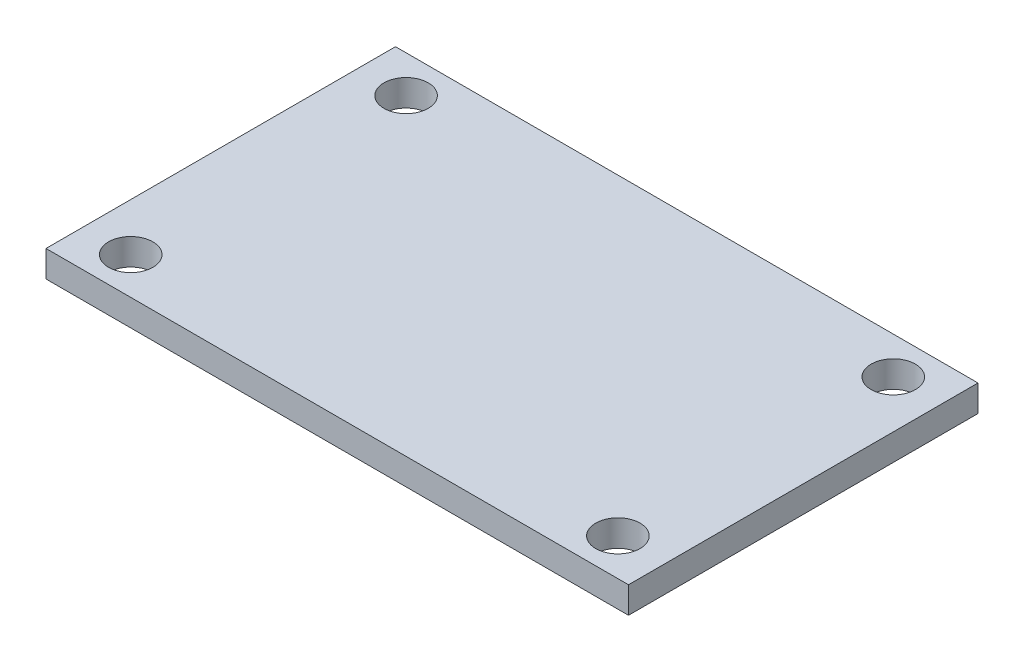
ISO-10303-21;
HEADER;
FILE_DESCRIPTION(('STEP AP214'),'2;1');
FILE_NAME('part.step','',(''),(''),'','','');
FILE_SCHEMA(('AUTOMOTIVE_DESIGN { 1 0 10303 214 1 1 1 1 }'));
ENDSEC;
DATA;
#1=APPLICATION_CONTEXT('core data for automotive mechanical design processes');
#2=APPLICATION_PROTOCOL_DEFINITION('international standard','automotive_design',2000,#1);
#3=PRODUCT_CONTEXT('',#1,'mechanical');
#4=PRODUCT('Part','Part','',(#3));
#5=PRODUCT_RELATED_PRODUCT_CATEGORY('part','',(#4));
#6=PRODUCT_DEFINITION_FORMATION('','',#4);
#7=PRODUCT_DEFINITION_CONTEXT('part definition',#1,'design');
#8=PRODUCT_DEFINITION('design','',#6,#7);
#9=PRODUCT_DEFINITION_SHAPE('','',#8);
#10=(LENGTH_UNIT() NAMED_UNIT(*) SI_UNIT(.MILLI.,.METRE.));
#11=(NAMED_UNIT(*) PLANE_ANGLE_UNIT() SI_UNIT($,.RADIAN.));
#12=(NAMED_UNIT(*) SI_UNIT($,.STERADIAN.) SOLID_ANGLE_UNIT());
#13=UNCERTAINTY_MEASURE_WITH_UNIT(LENGTH_MEASURE(1.E-05),#10,'distance_accuracy_value','');
#14=(GEOMETRIC_REPRESENTATION_CONTEXT(3) GLOBAL_UNCERTAINTY_ASSIGNED_CONTEXT((#13)) GLOBAL_UNIT_ASSIGNED_CONTEXT((#10,
#11,#12)) REPRESENTATION_CONTEXT('',''));
#15=CARTESIAN_POINT('',(0.,0.,0.));
#16=DIRECTION('',(0.,0.,1.));
#17=DIRECTION('',(1.,0.,0.));
#18=AXIS2_PLACEMENT_3D('',#15,#16,#17);
#19=CARTESIAN_POINT('',(-42.7686190505824,3.175,-22.2551637593528));
#20=DIRECTION('',(1.,0.,0.));
#21=DIRECTION('',(0.,0.,-1.));
#22=AXIS2_PLACEMENT_3D('',#19,#20,#21);
#23=PLANE('',#22);
#24=DIRECTION('',(0.,0.,1.));
#25=VECTOR('',#24,1.);
#26=CARTESIAN_POINT('',(-42.7686190505824,0.,-22.2551637593528));
#27=LINE('',#26,#25);
#28=CARTESIAN_POINT('',(-42.7686190505824,0.,-22.2551637593528));
#29=VERTEX_POINT('',#28);
#30=CARTESIAN_POINT('',(-42.7686190505824,0.,19.6548362406472));
#31=VERTEX_POINT('',#30);
#32=EDGE_CURVE('E128',#29,#31,#27,.T.);
#33=ORIENTED_EDGE('',*,*,#32,.T.);
#34=DIRECTION('',(0.,-1.,0.));
#35=VECTOR('',#34,1.);
#36=CARTESIAN_POINT('',(-42.7686190505824,3.175,19.6548362406472));
#37=LINE('',#36,#35);
#38=CARTESIAN_POINT('',(-42.7686190505824,3.175,19.6548362406472));
#39=VERTEX_POINT('',#38);
#40=EDGE_CURVE('E144',#39,#31,#37,.T.);
#41=ORIENTED_EDGE('',*,*,#40,.F.);
#42=DIRECTION('',(0.,0.,1.));
#43=VECTOR('',#42,1.);
#44=CARTESIAN_POINT('',(-42.7686190505824,3.175,-22.2551637593528));
#45=LINE('',#44,#43);
#46=CARTESIAN_POINT('',(-42.7686190505824,3.175,-22.2551637593528));
#47=VERTEX_POINT('',#46);
#48=EDGE_CURVE('E117',#47,#39,#45,.T.);
#49=ORIENTED_EDGE('',*,*,#48,.F.);
#50=DIRECTION('',(0.,-1.,0.));
#51=VECTOR('',#50,1.);
#52=CARTESIAN_POINT('',(-42.7686190505824,3.175,-22.2551637593528));
#53=LINE('',#52,#51);
#54=EDGE_CURVE('E127',#47,#29,#53,.T.);
#55=ORIENTED_EDGE('',*,*,#54,.T.);
#56=EDGE_LOOP('',(#33,#41,#49,#55));
#57=FACE_BOUND('',#56,.T.);
#58=ADVANCED_FACE('F35',(#57),#23,.F.);
#59=CARTESIAN_POINT('',(-42.7686190505824,3.175,19.6548362406472));
#60=DIRECTION('',(0.,0.,-1.));
#61=DIRECTION('',(-1.,0.,0.));
#62=AXIS2_PLACEMENT_3D('',#59,#60,#61);
#63=PLANE('',#62);
#64=DIRECTION('',(1.,0.,0.));
#65=VECTOR('',#64,1.);
#66=CARTESIAN_POINT('',(-42.7686190505824,0.,19.6548362406472));
#67=LINE('',#66,#65);
#68=CARTESIAN_POINT('',(27.0813809494176,0.,19.6548362406472));
#69=VERTEX_POINT('',#68);
#70=EDGE_CURVE('E131',#31,#69,#67,.T.);
#71=ORIENTED_EDGE('',*,*,#70,.T.);
#72=DIRECTION('',(0.,-1.,0.));
#73=VECTOR('',#72,1.);
#74=CARTESIAN_POINT('',(27.0813809494176,3.175,19.6548362406472));
#75=LINE('',#74,#73);
#76=CARTESIAN_POINT('',(27.0813809494176,3.175,19.6548362406472));
#77=VERTEX_POINT('',#76);
#78=EDGE_CURVE('E141',#77,#69,#75,.T.);
#79=ORIENTED_EDGE('',*,*,#78,.F.);
#80=DIRECTION('',(1.,0.,0.));
#81=VECTOR('',#80,1.);
#82=CARTESIAN_POINT('',(-42.7686190505824,3.175,19.6548362406472));
#83=LINE('',#82,#81);
#84=EDGE_CURVE('E120',#39,#77,#83,.T.);
#85=ORIENTED_EDGE('',*,*,#84,.F.);
#86=ORIENTED_EDGE('',*,*,#40,.T.);
#87=EDGE_LOOP('',(#71,#79,#85,#86));
#88=FACE_BOUND('',#87,.T.);
#89=ADVANCED_FACE('F184',(#88),#63,.F.);
#90=CARTESIAN_POINT('',(27.0813809494176,3.175,-22.2551637593528));
#91=DIRECTION('',(-1.,0.,0.));
#92=DIRECTION('',(0.,0.,1.));
#93=AXIS2_PLACEMENT_3D('',#90,#91,#92);
#94=PLANE('',#93);
#95=DIRECTION('',(0.,0.,-1.));
#96=VECTOR('',#95,1.);
#97=CARTESIAN_POINT('',(27.0813809494176,0.,-22.2551637593528));
#98=LINE('',#97,#96);
#99=CARTESIAN_POINT('',(27.0813809494176,0.,-22.2551637593528));
#100=VERTEX_POINT('',#99);
#101=EDGE_CURVE('E133',#69,#100,#98,.T.);
#102=ORIENTED_EDGE('',*,*,#101,.T.);
#103=DIRECTION('',(0.,-1.,0.));
#104=VECTOR('',#103,1.);
#105=CARTESIAN_POINT('',(27.0813809494176,3.175,-22.2551637593528));
#106=LINE('',#105,#104);
#107=CARTESIAN_POINT('',(27.0813809494176,3.175,-22.2551637593528));
#108=VERTEX_POINT('',#107);
#109=EDGE_CURVE('E138',#108,#100,#106,.T.);
#110=ORIENTED_EDGE('',*,*,#109,.F.);
#111=DIRECTION('',(0.,0.,-1.));
#112=VECTOR('',#111,1.);
#113=CARTESIAN_POINT('',(27.0813809494176,3.175,-22.2551637593528));
#114=LINE('',#113,#112);
#115=EDGE_CURVE('E123',#77,#108,#114,.T.);
#116=ORIENTED_EDGE('',*,*,#115,.F.);
#117=ORIENTED_EDGE('',*,*,#78,.T.);
#118=EDGE_LOOP('',(#102,#110,#116,#117));
#119=FACE_BOUND('',#118,.T.);
#120=ADVANCED_FACE('F190',(#119),#94,.F.);
#121=CARTESIAN_POINT('',(-42.7686190505824,3.175,-22.2551637593528));
#122=DIRECTION('',(0.,0.,1.));
#123=DIRECTION('',(1.,0.,0.));
#124=AXIS2_PLACEMENT_3D('',#121,#122,#123);
#125=PLANE('',#124);
#126=DIRECTION('',(-1.,0.,0.));
#127=VECTOR('',#126,1.);
#128=CARTESIAN_POINT('',(-42.7686190505824,0.,-22.2551637593528));
#129=LINE('',#128,#127);
#130=EDGE_CURVE('E121',#100,#29,#129,.T.);
#131=ORIENTED_EDGE('',*,*,#130,.T.);
#132=ORIENTED_EDGE('',*,*,#54,.F.);
#133=DIRECTION('',(-1.,0.,0.));
#134=VECTOR('',#133,1.);
#135=CARTESIAN_POINT('',(-42.7686190505824,3.175,-22.2551637593528));
#136=LINE('',#135,#134);
#137=EDGE_CURVE('E125',#108,#47,#136,.T.);
#138=ORIENTED_EDGE('',*,*,#137,.F.);
#139=ORIENTED_EDGE('',*,*,#109,.T.);
#140=EDGE_LOOP('',(#131,#132,#138,#139));
#141=FACE_BOUND('',#140,.T.);
#142=ADVANCED_FACE('F177',(#141),#125,.F.);
#143=CARTESIAN_POINT('',(-42.7686190505824,3.175,19.6548362406472));
#144=DIRECTION('',(0.,1.,0.));
#145=DIRECTION('',(0.,0.,1.));
#146=AXIS2_PLACEMENT_3D('',#143,#144,#145);
#147=PLANE('',#146);
#148=CARTESIAN_POINT('',(-37.0536190505824,3.175,15.2098362406472));
#149=DIRECTION('',(0.,1.,0.));
#150=DIRECTION('',(0.,0.,1.));
#151=AXIS2_PLACEMENT_3D('',#148,#149,#150);
#152=CIRCLE('',#151,2.6543);
#153=CARTESIAN_POINT('',(-37.0536190505824,3.175,17.8641362406472));
#154=VERTEX_POINT('',#153);
#155=EDGE_CURVE('E101',#154,#154,#152,.T.);
#156=ORIENTED_EDGE('',*,*,#155,.F.);
#157=EDGE_LOOP('',(#156));
#158=FACE_BOUND('',#157,.T.);
#159=CARTESIAN_POINT('',(21.3663809494176,3.175,15.2098362406472));
#160=DIRECTION('',(0.,1.,0.));
#161=DIRECTION('',(0.,0.,1.));
#162=AXIS2_PLACEMENT_3D('',#159,#160,#161);
#163=CIRCLE('',#162,2.6543);
#164=CARTESIAN_POINT('',(21.3663809494176,3.175,17.8641362406472));
#165=VERTEX_POINT('',#164);
#166=EDGE_CURVE('E105',#165,#165,#163,.T.);
#167=ORIENTED_EDGE('',*,*,#166,.F.);
#168=EDGE_LOOP('',(#167));
#169=FACE_BOUND('',#168,.T.);
#170=CARTESIAN_POINT('',(21.3663809494176,3.175,-17.8101637593528));
#171=DIRECTION('',(0.,1.,0.));
#172=DIRECTION('',(0.,0.,1.));
#173=AXIS2_PLACEMENT_3D('',#170,#171,#172);
#174=CIRCLE('',#173,2.6543);
#175=CARTESIAN_POINT('',(21.3663809494176,3.175,-15.1558637593528));
#176=VERTEX_POINT('',#175);
#177=EDGE_CURVE('E109',#176,#176,#174,.T.);
#178=ORIENTED_EDGE('',*,*,#177,.F.);
#179=EDGE_LOOP('',(#178));
#180=FACE_BOUND('',#179,.T.);
#181=CARTESIAN_POINT('',(-37.0536190505824,3.175,-17.8101637593528));
#182=DIRECTION('',(0.,1.,0.));
#183=DIRECTION('',(0.,0.,1.));
#184=AXIS2_PLACEMENT_3D('',#181,#182,#183);
#185=CIRCLE('',#184,2.6543);
#186=CARTESIAN_POINT('',(-37.0536190505824,3.175,-15.1558637593528));
#187=VERTEX_POINT('',#186);
#188=EDGE_CURVE('E113',#187,#187,#185,.T.);
#189=ORIENTED_EDGE('',*,*,#188,.F.);
#190=EDGE_LOOP('',(#189));
#191=FACE_BOUND('',#190,.T.);
#192=ORIENTED_EDGE('',*,*,#48,.T.);
#193=ORIENTED_EDGE('',*,*,#84,.T.);
#194=ORIENTED_EDGE('',*,*,#115,.T.);
#195=ORIENTED_EDGE('',*,*,#137,.T.);
#196=EDGE_LOOP('',(#192,#193,#194,#195));
#197=FACE_BOUND('',#196,.T.);
#198=ADVANCED_FACE('F167',(#158,#169,#180,#191,#197),#147,.T.);
#199=CARTESIAN_POINT('',(-42.7686190505824,0.,19.6548362406472));
#200=DIRECTION('',(0.,1.,0.));
#201=DIRECTION('',(0.,0.,1.));
#202=AXIS2_PLACEMENT_3D('',#199,#200,#201);
#203=PLANE('',#202);
#204=CARTESIAN_POINT('',(13.7463809494176,0.,15.8448362406472));
#205=DIRECTION('',(0.,-1.,0.));
#206=DIRECTION('',(0.,0.,-1.));
#207=AXIS2_PLACEMENT_3D('',#204,#205,#206);
#208=CIRCLE('',#207,1.25);
#209=CARTESIAN_POINT('',(13.7463809494176,0.,14.5948362406472));
#210=VERTEX_POINT('',#209);
#211=EDGE_CURVE('E91',#210,#210,#208,.T.);
#212=ORIENTED_EDGE('',*,*,#211,.F.);
#213=EDGE_LOOP('',(#212));
#214=FACE_BOUND('',#213,.T.);
#215=CARTESIAN_POINT('',(-29.4336190505824,0.,15.8448362406472));
#216=DIRECTION('',(0.,-1.,0.));
#217=DIRECTION('',(0.,0.,-1.));
#218=AXIS2_PLACEMENT_3D('',#215,#216,#217);
#219=CIRCLE('',#218,1.25);
#220=CARTESIAN_POINT('',(-29.4336190505824,0.,14.5948362406472));
#221=VERTEX_POINT('',#220);
#222=EDGE_CURVE('E90',#221,#221,#219,.T.);
#223=ORIENTED_EDGE('',*,*,#222,.F.);
#224=EDGE_LOOP('',(#223));
#225=FACE_BOUND('',#224,.T.);
#226=CARTESIAN_POINT('',(-37.0536190505824,0.,15.2098362406472));
#227=DIRECTION('',(0.,1.,0.));
#228=DIRECTION('',(0.,0.,1.));
#229=AXIS2_PLACEMENT_3D('',#226,#227,#228);
#230=CIRCLE('',#229,2.6543);
#231=CARTESIAN_POINT('',(-37.0536190505824,0.,17.8641362406472));
#232=VERTEX_POINT('',#231);
#233=EDGE_CURVE('E104',#232,#232,#230,.T.);
#234=ORIENTED_EDGE('',*,*,#233,.T.);
#235=EDGE_LOOP('',(#234));
#236=FACE_BOUND('',#235,.T.);
#237=CARTESIAN_POINT('',(21.3663809494176,0.,15.2098362406472));
#238=DIRECTION('',(0.,1.,0.));
#239=DIRECTION('',(0.,0.,1.));
#240=AXIS2_PLACEMENT_3D('',#237,#238,#239);
#241=CIRCLE('',#240,2.6543);
#242=CARTESIAN_POINT('',(21.3663809494176,0.,17.8641362406472));
#243=VERTEX_POINT('',#242);
#244=EDGE_CURVE('E108',#243,#243,#241,.T.);
#245=ORIENTED_EDGE('',*,*,#244,.T.);
#246=EDGE_LOOP('',(#245));
#247=FACE_BOUND('',#246,.T.);
#248=CARTESIAN_POINT('',(21.3663809494176,0.,-17.8101637593528));
#249=DIRECTION('',(0.,1.,0.));
#250=DIRECTION('',(0.,0.,1.));
#251=AXIS2_PLACEMENT_3D('',#248,#249,#250);
#252=CIRCLE('',#251,2.6543);
#253=CARTESIAN_POINT('',(21.3663809494176,0.,-15.1558637593528));
#254=VERTEX_POINT('',#253);
#255=EDGE_CURVE('E112',#254,#254,#252,.T.);
#256=ORIENTED_EDGE('',*,*,#255,.T.);
#257=EDGE_LOOP('',(#256));
#258=FACE_BOUND('',#257,.T.);
#259=CARTESIAN_POINT('',(-37.0536190505824,0.,-17.8101637593528));
#260=DIRECTION('',(0.,1.,0.));
#261=DIRECTION('',(0.,0.,1.));
#262=AXIS2_PLACEMENT_3D('',#259,#260,#261);
#263=CIRCLE('',#262,2.6543);
#264=CARTESIAN_POINT('',(-37.0536190505824,0.,-15.1558637593528));
#265=VERTEX_POINT('',#264);
#266=EDGE_CURVE('E116',#265,#265,#263,.T.);
#267=ORIENTED_EDGE('',*,*,#266,.T.);
#268=EDGE_LOOP('',(#267));
#269=FACE_BOUND('',#268,.T.);
#270=ORIENTED_EDGE('',*,*,#32,.F.);
#271=ORIENTED_EDGE('',*,*,#130,.F.);
#272=ORIENTED_EDGE('',*,*,#101,.F.);
#273=ORIENTED_EDGE('',*,*,#70,.F.);
#274=EDGE_LOOP('',(#270,#271,#272,#273));
#275=FACE_BOUND('',#274,.T.);
#276=CARTESIAN_POINT('',(-29.4336190505824,0.,-18.4451637593528));
#277=DIRECTION('',(0.,-1.,0.));
#278=DIRECTION('',(0.,0.,-1.));
#279=AXIS2_PLACEMENT_3D('',#276,#277,#278);
#280=CIRCLE('',#279,1.25);
#281=CARTESIAN_POINT('',(-29.4336190505824,0.,-19.6951637593528));
#282=VERTEX_POINT('',#281);
#283=EDGE_CURVE('E147',#282,#282,#280,.T.);
#284=ORIENTED_EDGE('',*,*,#283,.F.);
#285=EDGE_LOOP('',(#284));
#286=FACE_BOUND('',#285,.T.);
#287=CARTESIAN_POINT('',(13.7463809494176,0.,-18.4451637593528));
#288=DIRECTION('',(0.,-1.,0.));
#289=DIRECTION('',(0.,0.,-1.));
#290=AXIS2_PLACEMENT_3D('',#287,#288,#289);
#291=CIRCLE('',#290,1.25);
#292=CARTESIAN_POINT('',(13.7463809494176,0.,-19.6951637593528));
#293=VERTEX_POINT('',#292);
#294=EDGE_CURVE('E43',#293,#293,#291,.T.);
#295=ORIENTED_EDGE('',*,*,#294,.F.);
#296=EDGE_LOOP('',(#295));
#297=FACE_BOUND('',#296,.T.);
#298=ADVANCED_FACE('F164',(#214,#225,#236,#247,#258,#269,#275,#286,#297),#203,.F.);
#299=CARTESIAN_POINT('',(-37.0536190505824,3.175,-17.8101637593528));
#300=DIRECTION('',(0.,1.,0.));
#301=DIRECTION('',(0.,0.,1.));
#302=AXIS2_PLACEMENT_3D('',#299,#300,#301);
#303=CYLINDRICAL_SURFACE('',#302,2.6543);
#304=ORIENTED_EDGE('',*,*,#188,.T.);
#305=EDGE_LOOP('',(#304));
#306=FACE_BOUND('',#305,.T.);
#307=ORIENTED_EDGE('',*,*,#266,.F.);
#308=EDGE_LOOP('',(#307));
#309=FACE_BOUND('',#308,.T.);
#310=ADVANCED_FACE('F166',(#306,#309),#303,.F.);
#311=CARTESIAN_POINT('',(21.3663809494176,3.175,-17.8101637593528));
#312=DIRECTION('',(0.,1.,0.));
#313=DIRECTION('',(0.,0.,1.));
#314=AXIS2_PLACEMENT_3D('',#311,#312,#313);
#315=CYLINDRICAL_SURFACE('',#314,2.6543);
#316=ORIENTED_EDGE('',*,*,#177,.T.);
#317=EDGE_LOOP('',(#316));
#318=FACE_BOUND('',#317,.T.);
#319=ORIENTED_EDGE('',*,*,#255,.F.);
#320=EDGE_LOOP('',(#319));
#321=FACE_BOUND('',#320,.T.);
#322=ADVANCED_FACE('F174',(#318,#321),#315,.F.);
#323=CARTESIAN_POINT('',(21.3663809494176,3.175,15.2098362406472));
#324=DIRECTION('',(0.,1.,0.));
#325=DIRECTION('',(0.,0.,1.));
#326=AXIS2_PLACEMENT_3D('',#323,#324,#325);
#327=CYLINDRICAL_SURFACE('',#326,2.6543);
#328=ORIENTED_EDGE('',*,*,#166,.T.);
#329=EDGE_LOOP('',(#328));
#330=FACE_BOUND('',#329,.T.);
#331=ORIENTED_EDGE('',*,*,#244,.F.);
#332=EDGE_LOOP('',(#331));
#333=FACE_BOUND('',#332,.T.);
#334=ADVANCED_FACE('F251',(#330,#333),#327,.F.);
#335=CARTESIAN_POINT('',(-37.0536190505824,3.175,15.2098362406472));
#336=DIRECTION('',(0.,1.,0.));
#337=DIRECTION('',(0.,0.,1.));
#338=AXIS2_PLACEMENT_3D('',#335,#336,#337);
#339=CYLINDRICAL_SURFACE('',#338,2.6543);
#340=ORIENTED_EDGE('',*,*,#155,.T.);
#341=EDGE_LOOP('',(#340));
#342=FACE_BOUND('',#341,.T.);
#343=ORIENTED_EDGE('',*,*,#233,.F.);
#344=EDGE_LOOP('',(#343));
#345=FACE_BOUND('',#344,.T.);
#346=ADVANCED_FACE('F243',(#342,#345),#339,.F.);
#347=CARTESIAN_POINT('',(-29.4336190505824,2.286,15.8448362406472));
#348=DIRECTION('',(0.,-1.,0.));
#349=DIRECTION('',(0.,0.,-1.));
#350=AXIS2_PLACEMENT_3D('',#347,#348,#349);
#351=CONICAL_SURFACE('',#350,1.25,1.02974425867665);
#352=CARTESIAN_POINT('',(-29.4336190505824,3.03707577378445,15.8448362406472));
#353=VERTEX_POINT('',#352);
#354=VERTEX_LOOP('',#353);
#355=FACE_BOUND('',#354,.T.);
#356=CARTESIAN_POINT('',(-29.4336190505824,2.286,15.8448362406472));
#357=DIRECTION('',(0.,-1.,0.));
#358=DIRECTION('',(0.,0.,-1.));
#359=AXIS2_PLACEMENT_3D('',#356,#357,#358);
#360=CIRCLE('',#359,1.25);
#361=CARTESIAN_POINT('',(-29.4336190505824,2.286,14.5948362406472));
#362=VERTEX_POINT('',#361);
#363=EDGE_CURVE('E94',#362,#362,#360,.T.);
#364=ORIENTED_EDGE('',*,*,#363,.T.);
#365=EDGE_LOOP('',(#364));
#366=FACE_BOUND('',#365,.T.);
#367=ADVANCED_FACE('F235',(#355,#366),#351,.F.);
#368=CARTESIAN_POINT('',(-29.4336190505824,0.,15.8448362406472));
#369=DIRECTION('',(0.,-1.,0.));
#370=DIRECTION('',(0.,0.,-1.));
#371=AXIS2_PLACEMENT_3D('',#368,#369,#370);
#372=CYLINDRICAL_SURFACE('',#371,1.25);
#373=ORIENTED_EDGE('',*,*,#363,.F.);
#374=EDGE_LOOP('',(#373));
#375=FACE_BOUND('',#374,.T.);
#376=ORIENTED_EDGE('',*,*,#222,.T.);
#377=EDGE_LOOP('',(#376));
#378=FACE_BOUND('',#377,.T.);
#379=ADVANCED_FACE('F84',(#375,#378),#372,.F.);
#380=CARTESIAN_POINT('',(13.7463809494176,2.286,15.8448362406472));
#381=DIRECTION('',(0.,-1.,0.));
#382=DIRECTION('',(0.,0.,-1.));
#383=AXIS2_PLACEMENT_3D('',#380,#381,#382);
#384=CONICAL_SURFACE('',#383,1.25,1.02974425867665);
#385=CARTESIAN_POINT('',(13.7463809494176,3.03707577378445,15.8448362406472));
#386=VERTEX_POINT('',#385);
#387=VERTEX_LOOP('',#386);
#388=FACE_BOUND('',#387,.T.);
#389=CARTESIAN_POINT('',(13.7463809494176,2.286,15.8448362406472));
#390=DIRECTION('',(0.,-1.,0.));
#391=DIRECTION('',(0.,0.,-1.));
#392=AXIS2_PLACEMENT_3D('',#389,#390,#391);
#393=CIRCLE('',#392,1.25);
#394=CARTESIAN_POINT('',(13.7463809494176,2.286,14.5948362406472));
#395=VERTEX_POINT('',#394);
#396=EDGE_CURVE('E88',#395,#395,#393,.T.);
#397=ORIENTED_EDGE('',*,*,#396,.T.);
#398=EDGE_LOOP('',(#397));
#399=FACE_BOUND('',#398,.T.);
#400=ADVANCED_FACE('F80',(#388,#399),#384,.F.);
#401=CARTESIAN_POINT('',(13.7463809494176,0.,15.8448362406472));
#402=DIRECTION('',(0.,-1.,0.));
#403=DIRECTION('',(0.,0.,-1.));
#404=AXIS2_PLACEMENT_3D('',#401,#402,#403);
#405=CYLINDRICAL_SURFACE('',#404,1.25);
#406=ORIENTED_EDGE('',*,*,#396,.F.);
#407=EDGE_LOOP('',(#406));
#408=FACE_BOUND('',#407,.T.);
#409=ORIENTED_EDGE('',*,*,#211,.T.);
#410=EDGE_LOOP('',(#409));
#411=FACE_BOUND('',#410,.T.);
#412=ADVANCED_FACE('F83',(#408,#411),#405,.F.);
#413=CARTESIAN_POINT('',(-29.4336190505824,0.,-18.4451637593528));
#414=DIRECTION('',(0.,-1.,0.));
#415=DIRECTION('',(0.,0.,-1.));
#416=AXIS2_PLACEMENT_3D('',#413,#414,#415);
#417=CYLINDRICAL_SURFACE('',#416,1.25);
#418=CARTESIAN_POINT('',(-29.4336190505824,2.286,-18.4451637593528));
#419=DIRECTION('',(0.,-1.,0.));
#420=DIRECTION('',(0.,0.,-1.));
#421=AXIS2_PLACEMENT_3D('',#418,#419,#420);
#422=CIRCLE('',#421,1.25);
#423=CARTESIAN_POINT('',(-29.4336190505824,2.286,-19.6951637593528));
#424=VERTEX_POINT('',#423);
#425=EDGE_CURVE('E158',#424,#424,#422,.T.);
#426=ORIENTED_EDGE('',*,*,#425,.F.);
#427=EDGE_LOOP('',(#426));
#428=FACE_BOUND('',#427,.T.);
#429=ORIENTED_EDGE('',*,*,#283,.T.);
#430=EDGE_LOOP('',(#429));
#431=FACE_BOUND('',#430,.T.);
#432=ADVANCED_FACE('F198',(#428,#431),#417,.F.);
#433=CARTESIAN_POINT('',(-29.4336190505824,2.286,-18.4451637593528));
#434=DIRECTION('',(0.,-1.,0.));
#435=DIRECTION('',(0.,0.,-1.));
#436=AXIS2_PLACEMENT_3D('',#433,#434,#435);
#437=CONICAL_SURFACE('',#436,1.25,1.02974425867665);
#438=CARTESIAN_POINT('',(-29.4336190505824,3.03707577378445,-18.4451637593528));
#439=VERTEX_POINT('',#438);
#440=VERTEX_LOOP('',#439);
#441=FACE_BOUND('',#440,.T.);
#442=ORIENTED_EDGE('',*,*,#425,.T.);
#443=EDGE_LOOP('',(#442));
#444=FACE_BOUND('',#443,.T.);
#445=ADVANCED_FACE('F195',(#441,#444),#437,.F.);
#446=CARTESIAN_POINT('',(13.7463809494176,0.,-18.4451637593528));
#447=DIRECTION('',(0.,-1.,0.));
#448=DIRECTION('',(0.,0.,-1.));
#449=AXIS2_PLACEMENT_3D('',#446,#447,#448);
#450=CYLINDRICAL_SURFACE('',#449,1.25);
#451=CARTESIAN_POINT('',(13.7463809494176,2.286,-18.4451637593528));
#452=DIRECTION('',(0.,-1.,0.));
#453=DIRECTION('',(0.,0.,-1.));
#454=AXIS2_PLACEMENT_3D('',#451,#452,#453);
#455=CIRCLE('',#454,1.25);
#456=CARTESIAN_POINT('',(13.7463809494176,2.286,-19.6951637593528));
#457=VERTEX_POINT('',#456);
#458=EDGE_CURVE('E11',#457,#457,#455,.T.);
#459=ORIENTED_EDGE('',*,*,#458,.F.);
#460=EDGE_LOOP('',(#459));
#461=FACE_BOUND('',#460,.T.);
#462=ORIENTED_EDGE('',*,*,#294,.T.);
#463=EDGE_LOOP('',(#462));
#464=FACE_BOUND('',#463,.T.);
#465=ADVANCED_FACE('F37',(#461,#464),#450,.F.);
#466=CARTESIAN_POINT('',(13.7463809494176,2.286,-18.4451637593528));
#467=DIRECTION('',(0.,-1.,0.));
#468=DIRECTION('',(0.,0.,-1.));
#469=AXIS2_PLACEMENT_3D('',#466,#467,#468);
#470=CONICAL_SURFACE('',#469,1.25,1.02974425867665);
#471=CARTESIAN_POINT('',(13.7463809494176,3.03707577378445,-18.4451637593528));
#472=VERTEX_POINT('',#471);
#473=VERTEX_LOOP('',#472);
#474=FACE_BOUND('',#473,.T.);
#475=ORIENTED_EDGE('',*,*,#458,.T.);
#476=EDGE_LOOP('',(#475));
#477=FACE_BOUND('',#476,.T.);
#478=ADVANCED_FACE('F201',(#474,#477),#470,.F.);
#479=CLOSED_SHELL('',(#58,#89,#120,#142,#198,#298,#310,#322,#334,#346,#367,#379,#400,#412,#432,
#445,#465,#478));
#480=MANIFOLD_SOLID_BREP('B2',#479);
#481=ADVANCED_BREP_SHAPE_REPRESENTATION('',(#18,#480),#14);
#482=SHAPE_DEFINITION_REPRESENTATION(#9,#481);
ENDSEC;
END-ISO-10303-21;
